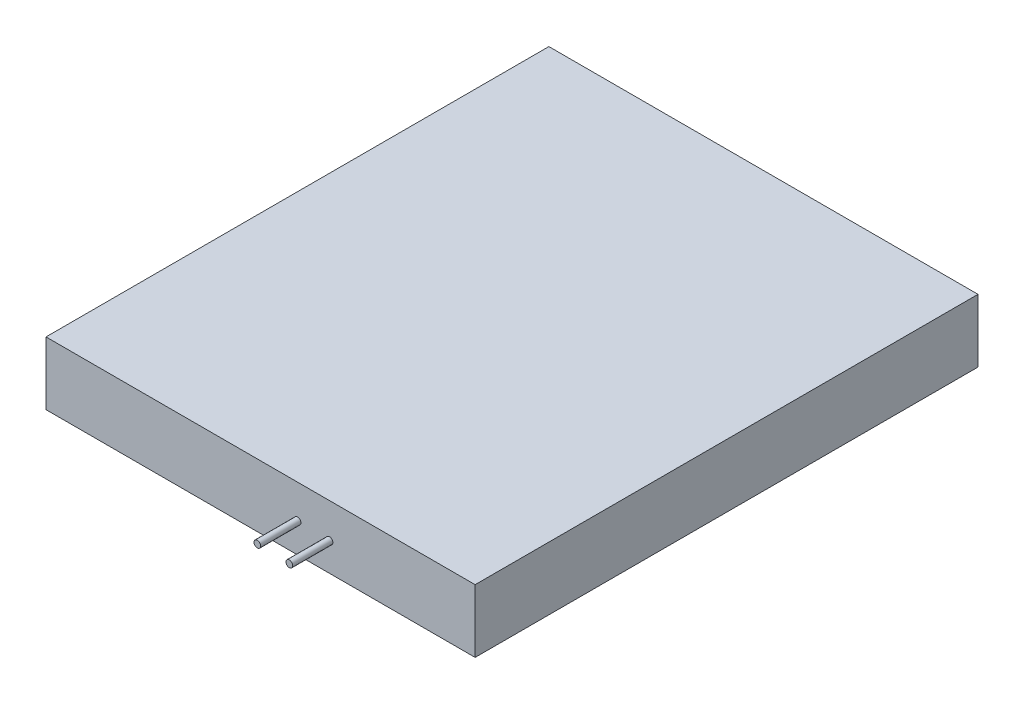
ISO-10303-21;
HEADER;
FILE_DESCRIPTION(('STEP AP214'),'2;1');
FILE_NAME('part.step','',(''),(''),'','','');
FILE_SCHEMA(('AUTOMOTIVE_DESIGN { 1 0 10303 214 1 1 1 1 }'));
ENDSEC;
DATA;
#1=APPLICATION_CONTEXT('core data for automotive mechanical design processes');
#2=APPLICATION_PROTOCOL_DEFINITION('international standard','automotive_design',2000,#1);
#3=PRODUCT_CONTEXT('',#1,'mechanical');
#4=PRODUCT('Part','Part','',(#3));
#5=PRODUCT_RELATED_PRODUCT_CATEGORY('part','',(#4));
#6=PRODUCT_DEFINITION_FORMATION('','',#4);
#7=PRODUCT_DEFINITION_CONTEXT('part definition',#1,'design');
#8=PRODUCT_DEFINITION('design','',#6,#7);
#9=PRODUCT_DEFINITION_SHAPE('','',#8);
#10=(LENGTH_UNIT() NAMED_UNIT(*) SI_UNIT(.MILLI.,.METRE.));
#11=(NAMED_UNIT(*) PLANE_ANGLE_UNIT() SI_UNIT($,.RADIAN.));
#12=(NAMED_UNIT(*) SI_UNIT($,.STERADIAN.) SOLID_ANGLE_UNIT());
#13=UNCERTAINTY_MEASURE_WITH_UNIT(LENGTH_MEASURE(1.E-05),#10,'distance_accuracy_value','');
#14=(GEOMETRIC_REPRESENTATION_CONTEXT(3) GLOBAL_UNCERTAINTY_ASSIGNED_CONTEXT((#13)) GLOBAL_UNIT_ASSIGNED_CONTEXT((#10,
#11,#12)) REPRESENTATION_CONTEXT('',''));
#15=CARTESIAN_POINT('',(0.,0.,0.));
#16=DIRECTION('',(0.,0.,1.));
#17=DIRECTION('',(1.,0.,0.));
#18=AXIS2_PLACEMENT_3D('',#15,#16,#17);
#19=CARTESIAN_POINT('',(0.,9.4,0.));
#20=DIRECTION('',(0.,0.,-1.));
#21=DIRECTION('',(-1.,0.,0.));
#22=AXIS2_PLACEMENT_3D('',#19,#20,#21);
#23=PLANE('',#22);
#24=CARTESIAN_POINT('',(37.5159483964532,4.39724037147471,0.));
#25=DIRECTION('',(0.,0.,-1.));
#26=DIRECTION('',(-1.,0.,0.));
#27=AXIS2_PLACEMENT_3D('',#24,#25,#26);
#28=CIRCLE('',#27,0.499999999999999);
#29=CARTESIAN_POINT('',(37.0159483964532,4.39724037147471,0.));
#30=VERTEX_POINT('',#29);
#31=EDGE_CURVE('E40',#30,#30,#28,.F.);
#32=ORIENTED_EDGE('',*,*,#31,.F.);
#33=EDGE_LOOP('',(#32));
#34=FACE_BOUND('',#33,.T.);
#35=DIRECTION('',(1.,0.,0.));
#36=VECTOR('',#35,1.);
#37=CARTESIAN_POINT('',(0.,0.,0.));
#38=LINE('',#37,#36);
#39=CARTESIAN_POINT('',(0.,0.,0.));
#40=VERTEX_POINT('',#39);
#41=CARTESIAN_POINT('',(64.,0.,0.));
#42=VERTEX_POINT('',#41);
#43=EDGE_CURVE('E89',#40,#42,#38,.T.);
#44=ORIENTED_EDGE('',*,*,#43,.T.);
#45=DIRECTION('',(0.,-1.,0.));
#46=VECTOR('',#45,1.);
#47=CARTESIAN_POINT('',(64.,9.4,0.));
#48=LINE('',#47,#46);
#49=CARTESIAN_POINT('',(64.,9.4,0.));
#50=VERTEX_POINT('',#49);
#51=EDGE_CURVE('E87',#50,#42,#48,.T.);
#52=ORIENTED_EDGE('',*,*,#51,.F.);
#53=DIRECTION('',(1.,0.,0.));
#54=VECTOR('',#53,1.);
#55=CARTESIAN_POINT('',(0.,9.4,0.));
#56=LINE('',#55,#54);
#57=CARTESIAN_POINT('',(0.,9.4,0.));
#58=VERTEX_POINT('',#57);
#59=EDGE_CURVE('E79',#58,#50,#56,.T.);
#60=ORIENTED_EDGE('',*,*,#59,.F.);
#61=DIRECTION('',(0.,-1.,0.));
#62=VECTOR('',#61,1.);
#63=CARTESIAN_POINT('',(0.,9.4,0.));
#64=LINE('',#63,#62);
#65=EDGE_CURVE('E90',#58,#40,#64,.T.);
#66=ORIENTED_EDGE('',*,*,#65,.T.);
#67=EDGE_LOOP('',(#44,#52,#60,#66));
#68=FACE_BOUND('',#67,.T.);
#69=CARTESIAN_POINT('',(42.2853926037939,4.23413538544537,0.));
#70=DIRECTION('',(0.,0.,-1.));
#71=DIRECTION('',(-1.,0.,0.));
#72=AXIS2_PLACEMENT_3D('',#69,#70,#71);
#73=CIRCLE('',#72,0.499999999999999);
#74=CARTESIAN_POINT('',(41.7853926037939,4.23413538544537,0.));
#75=VERTEX_POINT('',#74);
#76=EDGE_CURVE('E11',#75,#75,#73,.F.);
#77=ORIENTED_EDGE('',*,*,#76,.F.);
#78=EDGE_LOOP('',(#77));
#79=FACE_BOUND('',#78,.T.);
#80=ADVANCED_FACE('F31',(#34,#68,#79),#23,.F.);
#81=CARTESIAN_POINT('',(0.,9.4,0.));
#82=DIRECTION('',(1.,0.,0.));
#83=DIRECTION('',(0.,0.,-1.));
#84=AXIS2_PLACEMENT_3D('',#81,#82,#83);
#85=PLANE('',#84);
#86=DIRECTION('',(0.,0.,1.));
#87=VECTOR('',#86,1.);
#88=CARTESIAN_POINT('',(0.,0.,0.));
#89=LINE('',#88,#87);
#90=CARTESIAN_POINT('',(0.,0.,-75.));
#91=VERTEX_POINT('',#90);
#92=EDGE_CURVE('E99',#91,#40,#89,.T.);
#93=ORIENTED_EDGE('',*,*,#92,.T.);
#94=ORIENTED_EDGE('',*,*,#65,.F.);
#95=DIRECTION('',(0.,0.,1.));
#96=VECTOR('',#95,1.);
#97=CARTESIAN_POINT('',(0.,9.4,0.));
#98=LINE('',#97,#96);
#99=CARTESIAN_POINT('',(0.,9.4,-75.));
#100=VERTEX_POINT('',#99);
#101=EDGE_CURVE('E84',#100,#58,#98,.T.);
#102=ORIENTED_EDGE('',*,*,#101,.F.);
#103=DIRECTION('',(0.,-1.,0.));
#104=VECTOR('',#103,1.);
#105=CARTESIAN_POINT('',(0.,9.4,-75.));
#106=LINE('',#105,#104);
#107=EDGE_CURVE('E95',#100,#91,#106,.T.);
#108=ORIENTED_EDGE('',*,*,#107,.T.);
#109=EDGE_LOOP('',(#93,#94,#102,#108));
#110=FACE_BOUND('',#109,.T.);
#111=ADVANCED_FACE('F33',(#110),#85,.F.);
#112=CARTESIAN_POINT('',(64.,9.4,0.));
#113=DIRECTION('',(-1.,0.,0.));
#114=DIRECTION('',(0.,0.,1.));
#115=AXIS2_PLACEMENT_3D('',#112,#113,#114);
#116=PLANE('',#115);
#117=DIRECTION('',(0.,0.,-1.));
#118=VECTOR('',#117,1.);
#119=CARTESIAN_POINT('',(64.,0.,0.));
#120=LINE('',#119,#118);
#121=CARTESIAN_POINT('',(64.,0.,-75.));
#122=VERTEX_POINT('',#121);
#123=EDGE_CURVE('E65',#42,#122,#120,.T.);
#124=ORIENTED_EDGE('',*,*,#123,.T.);
#125=DIRECTION('',(0.,-1.,0.));
#126=VECTOR('',#125,1.);
#127=CARTESIAN_POINT('',(64.,9.4,-75.));
#128=LINE('',#127,#126);
#129=CARTESIAN_POINT('',(64.,9.4,-75.));
#130=VERTEX_POINT('',#129);
#131=EDGE_CURVE('E91',#130,#122,#128,.T.);
#132=ORIENTED_EDGE('',*,*,#131,.F.);
#133=DIRECTION('',(0.,0.,-1.));
#134=VECTOR('',#133,1.);
#135=CARTESIAN_POINT('',(64.,9.4,0.));
#136=LINE('',#135,#134);
#137=EDGE_CURVE('E82',#50,#130,#136,.T.);
#138=ORIENTED_EDGE('',*,*,#137,.F.);
#139=ORIENTED_EDGE('',*,*,#51,.T.);
#140=EDGE_LOOP('',(#124,#132,#138,#139));
#141=FACE_BOUND('',#140,.T.);
#142=ADVANCED_FACE('F93',(#141),#116,.F.);
#143=CARTESIAN_POINT('',(0.,9.4,-75.));
#144=DIRECTION('',(0.,0.,1.));
#145=DIRECTION('',(1.,0.,0.));
#146=AXIS2_PLACEMENT_3D('',#143,#144,#145);
#147=PLANE('',#146);
#148=DIRECTION('',(-1.,0.,0.));
#149=VECTOR('',#148,1.);
#150=CARTESIAN_POINT('',(0.,0.,-75.));
#151=LINE('',#150,#149);
#152=EDGE_CURVE('E71',#122,#91,#151,.T.);
#153=ORIENTED_EDGE('',*,*,#152,.T.);
#154=ORIENTED_EDGE('',*,*,#107,.F.);
#155=DIRECTION('',(-1.,0.,0.));
#156=VECTOR('',#155,1.);
#157=CARTESIAN_POINT('',(0.,9.4,-75.));
#158=LINE('',#157,#156);
#159=EDGE_CURVE('E48',#130,#100,#158,.T.);
#160=ORIENTED_EDGE('',*,*,#159,.F.);
#161=ORIENTED_EDGE('',*,*,#131,.T.);
#162=EDGE_LOOP('',(#153,#154,#160,#161));
#163=FACE_BOUND('',#162,.T.);
#164=ADVANCED_FACE('F123',(#163),#147,.F.);
#165=CARTESIAN_POINT('',(0.,9.4,-75.));
#166=DIRECTION('',(0.,-1.,0.));
#167=DIRECTION('',(0.,0.,-1.));
#168=AXIS2_PLACEMENT_3D('',#165,#166,#167);
#169=PLANE('',#168);
#170=ORIENTED_EDGE('',*,*,#101,.T.);
#171=ORIENTED_EDGE('',*,*,#59,.T.);
#172=ORIENTED_EDGE('',*,*,#137,.T.);
#173=ORIENTED_EDGE('',*,*,#159,.T.);
#174=EDGE_LOOP('',(#170,#171,#172,#173));
#175=FACE_BOUND('',#174,.T.);
#176=ADVANCED_FACE('F80',(#175),#169,.F.);
#177=CARTESIAN_POINT('',(0.,0.,-75.));
#178=DIRECTION('',(0.,-1.,0.));
#179=DIRECTION('',(0.,0.,-1.));
#180=AXIS2_PLACEMENT_3D('',#177,#178,#179);
#181=PLANE('',#180);
#182=ORIENTED_EDGE('',*,*,#92,.F.);
#183=ORIENTED_EDGE('',*,*,#152,.F.);
#184=ORIENTED_EDGE('',*,*,#123,.F.);
#185=ORIENTED_EDGE('',*,*,#43,.F.);
#186=EDGE_LOOP('',(#182,#183,#184,#185));
#187=FACE_BOUND('',#186,.T.);
#188=ADVANCED_FACE('F126',(#187),#181,.T.);
#189=CARTESIAN_POINT('',(37.5159483964532,4.39724037147471,6.));
#190=DIRECTION('',(0.,0.,-1.));
#191=DIRECTION('',(-1.,0.,0.));
#192=AXIS2_PLACEMENT_3D('',#189,#190,#191);
#193=CYLINDRICAL_SURFACE('',#192,0.499999999999999);
#194=CARTESIAN_POINT('',(37.5159483964532,4.39724037147471,6.));
#195=DIRECTION('',(0.,0.,1.));
#196=DIRECTION('',(1.,0.,0.));
#197=AXIS2_PLACEMENT_3D('',#194,#195,#196);
#198=CIRCLE('',#197,0.499999999999999);
#199=CARTESIAN_POINT('',(38.0159483964532,4.39724037147471,6.));
#200=VERTEX_POINT('',#199);
#201=EDGE_CURVE('E102',#200,#200,#198,.T.);
#202=ORIENTED_EDGE('',*,*,#201,.F.);
#203=EDGE_LOOP('',(#202));
#204=FACE_BOUND('',#203,.T.);
#205=ORIENTED_EDGE('',*,*,#31,.T.);
#206=EDGE_LOOP('',(#205));
#207=FACE_BOUND('',#206,.T.);
#208=ADVANCED_FACE('F111',(#204,#207),#193,.T.);
#209=CARTESIAN_POINT('',(37.5159483964532,4.39724037147471,6.));
#210=DIRECTION('',(0.,0.,1.));
#211=DIRECTION('',(1.,0.,0.));
#212=AXIS2_PLACEMENT_3D('',#209,#210,#211);
#213=PLANE('',#212);
#214=ORIENTED_EDGE('',*,*,#201,.T.);
#215=EDGE_LOOP('',(#214));
#216=FACE_BOUND('',#215,.T.);
#217=ADVANCED_FACE('F134',(#216),#213,.T.);
#218=CARTESIAN_POINT('',(42.2853926037939,4.23413538544537,6.));
#219=DIRECTION('',(0.,0.,-1.));
#220=DIRECTION('',(-1.,0.,0.));
#221=AXIS2_PLACEMENT_3D('',#218,#219,#220);
#222=CYLINDRICAL_SURFACE('',#221,0.499999999999999);
#223=CARTESIAN_POINT('',(42.2853926037939,4.23413538544537,6.));
#224=DIRECTION('',(0.,0.,1.));
#225=DIRECTION('',(1.,0.,0.));
#226=AXIS2_PLACEMENT_3D('',#223,#224,#225);
#227=CIRCLE('',#226,0.499999999999999);
#228=CARTESIAN_POINT('',(42.7853926037939,4.23413538544537,6.));
#229=VERTEX_POINT('',#228);
#230=EDGE_CURVE('E150',#229,#229,#227,.T.);
#231=ORIENTED_EDGE('',*,*,#230,.F.);
#232=EDGE_LOOP('',(#231));
#233=FACE_BOUND('',#232,.T.);
#234=ORIENTED_EDGE('',*,*,#76,.T.);
#235=EDGE_LOOP('',(#234));
#236=FACE_BOUND('',#235,.T.);
#237=ADVANCED_FACE('F138',(#233,#236),#222,.T.);
#238=CARTESIAN_POINT('',(42.2853926037939,4.23413538544537,6.));
#239=DIRECTION('',(0.,0.,1.));
#240=DIRECTION('',(1.,0.,0.));
#241=AXIS2_PLACEMENT_3D('',#238,#239,#240);
#242=PLANE('',#241);
#243=ORIENTED_EDGE('',*,*,#230,.T.);
#244=EDGE_LOOP('',(#243));
#245=FACE_BOUND('',#244,.T.);
#246=ADVANCED_FACE('F142',(#245),#242,.T.);
#247=CLOSED_SHELL('',(#80,#111,#142,#164,#176,#188,#208,#217,#237,#246));
#248=MANIFOLD_SOLID_BREP('B2',#247);
#249=ADVANCED_BREP_SHAPE_REPRESENTATION('',(#18,#248),#14);
#250=SHAPE_DEFINITION_REPRESENTATION(#9,#249);
ENDSEC;
END-ISO-10303-21;
